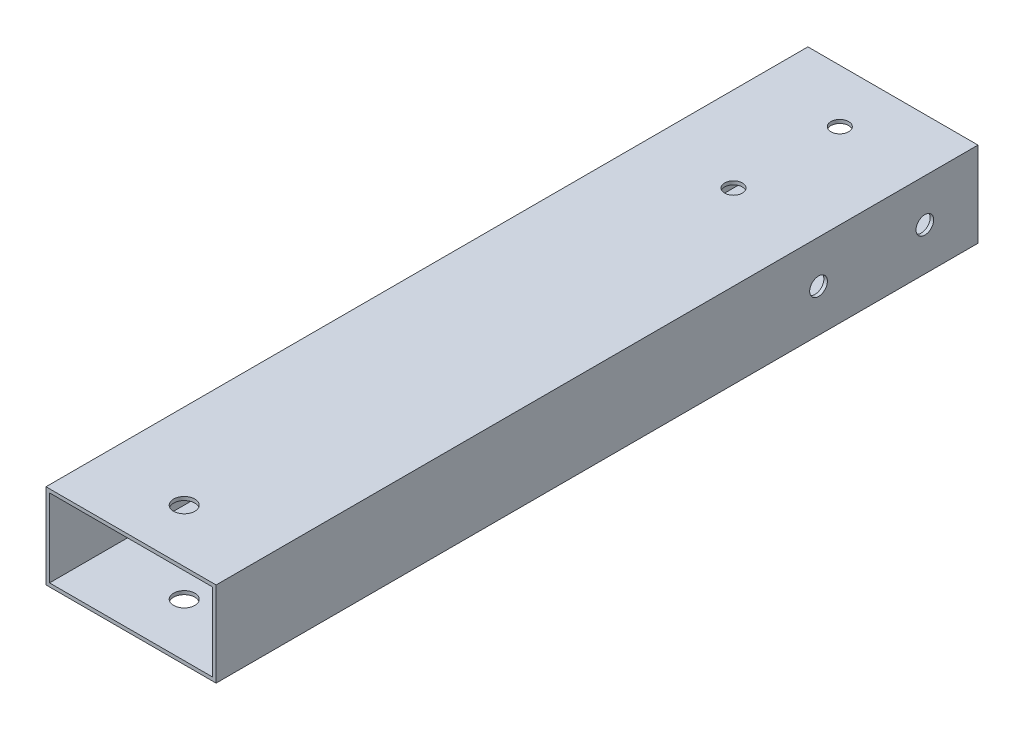
ISO-10303-21;
HEADER;
FILE_DESCRIPTION(('STEP AP214'),'2;1');
FILE_NAME('part.step','',(''),(''),'','','');
FILE_SCHEMA(('AUTOMOTIVE_DESIGN { 1 0 10303 214 1 1 1 1 }'));
ENDSEC;
DATA;
#1=APPLICATION_CONTEXT('core data for automotive mechanical design processes');
#2=APPLICATION_PROTOCOL_DEFINITION('international standard','automotive_design',2000,#1);
#3=PRODUCT_CONTEXT('',#1,'mechanical');
#4=PRODUCT('Part','Part','',(#3));
#5=PRODUCT_RELATED_PRODUCT_CATEGORY('part','',(#4));
#6=PRODUCT_DEFINITION_FORMATION('','',#4);
#7=PRODUCT_DEFINITION_CONTEXT('part definition',#1,'design');
#8=PRODUCT_DEFINITION('design','',#6,#7);
#9=PRODUCT_DEFINITION_SHAPE('','',#8);
#10=(LENGTH_UNIT() NAMED_UNIT(*) SI_UNIT(.MILLI.,.METRE.));
#11=(NAMED_UNIT(*) PLANE_ANGLE_UNIT() SI_UNIT($,.RADIAN.));
#12=(NAMED_UNIT(*) SI_UNIT($,.STERADIAN.) SOLID_ANGLE_UNIT());
#13=UNCERTAINTY_MEASURE_WITH_UNIT(LENGTH_MEASURE(1.E-05),#10,'distance_accuracy_value','');
#14=(GEOMETRIC_REPRESENTATION_CONTEXT(3) GLOBAL_UNCERTAINTY_ASSIGNED_CONTEXT((#13)) GLOBAL_UNIT_ASSIGNED_CONTEXT((#10,
#11,#12)) REPRESENTATION_CONTEXT('',''));
#15=CARTESIAN_POINT('',(0.,0.,0.));
#16=DIRECTION('',(0.,0.,1.));
#17=DIRECTION('',(1.,0.,0.));
#18=AXIS2_PLACEMENT_3D('',#15,#16,#17);
#19=CARTESIAN_POINT('',(0.,0.,0.));
#20=DIRECTION('',(0.,0.,1.));
#21=DIRECTION('',(1.,0.,0.));
#22=AXIS2_PLACEMENT_3D('',#19,#20,#21);
#23=PLANE('',#22);
#24=DIRECTION('',(0.,1.,0.));
#25=VECTOR('',#24,1.);
#26=CARTESIAN_POINT('',(24.,12.,0.));
#27=LINE('',#26,#25);
#28=CARTESIAN_POINT('',(24.,-12.,0.));
#29=VERTEX_POINT('',#28);
#30=CARTESIAN_POINT('',(24.,12.,0.));
#31=VERTEX_POINT('',#30);
#32=EDGE_CURVE('E209',#29,#31,#27,.T.);
#33=ORIENTED_EDGE('',*,*,#32,.F.);
#34=DIRECTION('',(1.,0.,0.));
#35=VECTOR('',#34,1.);
#36=CARTESIAN_POINT('',(-24.,-12.,0.));
#37=LINE('',#36,#35);
#38=CARTESIAN_POINT('',(-24.,-12.,0.));
#39=VERTEX_POINT('',#38);
#40=EDGE_CURVE('E215',#39,#29,#37,.T.);
#41=ORIENTED_EDGE('',*,*,#40,.F.);
#42=DIRECTION('',(0.,-1.,0.));
#43=VECTOR('',#42,1.);
#44=CARTESIAN_POINT('',(-24.,12.,0.));
#45=LINE('',#44,#43);
#46=CARTESIAN_POINT('',(-24.,12.,0.));
#47=VERTEX_POINT('',#46);
#48=EDGE_CURVE('E213',#47,#39,#45,.T.);
#49=ORIENTED_EDGE('',*,*,#48,.F.);
#50=DIRECTION('',(-1.,0.,0.));
#51=VECTOR('',#50,1.);
#52=CARTESIAN_POINT('',(-24.,12.,0.));
#53=LINE('',#52,#51);
#54=EDGE_CURVE('E122',#31,#47,#53,.T.);
#55=ORIENTED_EDGE('',*,*,#54,.F.);
#56=EDGE_LOOP('',(#33,#41,#49,#55));
#57=FACE_BOUND('',#56,.T.);
#58=DIRECTION('',(-1.,0.,0.));
#59=VECTOR('',#58,1.);
#60=CARTESIAN_POINT('',(-23.,11.,0.));
#61=LINE('',#60,#59);
#62=CARTESIAN_POINT('',(23.,11.,0.));
#63=VERTEX_POINT('',#62);
#64=CARTESIAN_POINT('',(-23.,11.,0.));
#65=VERTEX_POINT('',#64);
#66=EDGE_CURVE('E189',#63,#65,#61,.T.);
#67=ORIENTED_EDGE('',*,*,#66,.T.);
#68=DIRECTION('',(0.,-1.,0.));
#69=VECTOR('',#68,1.);
#70=CARTESIAN_POINT('',(-23.,11.,0.));
#71=LINE('',#70,#69);
#72=CARTESIAN_POINT('',(-23.,-11.,0.));
#73=VERTEX_POINT('',#72);
#74=EDGE_CURVE('E192',#65,#73,#71,.T.);
#75=ORIENTED_EDGE('',*,*,#74,.T.);
#76=DIRECTION('',(1.,0.,0.));
#77=VECTOR('',#76,1.);
#78=CARTESIAN_POINT('',(-23.,-11.,0.));
#79=LINE('',#78,#77);
#80=CARTESIAN_POINT('',(23.,-11.,0.));
#81=VERTEX_POINT('',#80);
#82=EDGE_CURVE('E195',#73,#81,#79,.T.);
#83=ORIENTED_EDGE('',*,*,#82,.T.);
#84=DIRECTION('',(0.,1.,0.));
#85=VECTOR('',#84,1.);
#86=CARTESIAN_POINT('',(23.,11.,0.));
#87=LINE('',#86,#85);
#88=EDGE_CURVE('E198',#81,#63,#87,.T.);
#89=ORIENTED_EDGE('',*,*,#88,.T.);
#90=EDGE_LOOP('',(#67,#75,#83,#89));
#91=FACE_BOUND('',#90,.T.);
#92=ADVANCED_FACE('F41',(#57,#91),#23,.F.);
#93=CARTESIAN_POINT('',(24.,12.,240.));
#94=DIRECTION('',(-1.,0.,0.));
#95=DIRECTION('',(0.,0.,1.));
#96=AXIS2_PLACEMENT_3D('',#93,#94,#95);
#97=PLANE('',#96);
#98=CARTESIAN_POINT('',(24.,0.,45.));
#99=DIRECTION('',(1.,0.,0.));
#100=DIRECTION('',(0.,0.,-1.));
#101=AXIS2_PLACEMENT_3D('',#98,#99,#100);
#102=CIRCLE('',#101,2.50000000000002);
#103=CARTESIAN_POINT('',(24.,0.,42.5));
#104=VERTEX_POINT('',#103);
#105=EDGE_CURVE('E148',#104,#104,#102,.T.);
#106=ORIENTED_EDGE('',*,*,#105,.F.);
#107=EDGE_LOOP('',(#106));
#108=FACE_BOUND('',#107,.T.);
#109=CARTESIAN_POINT('',(24.,0.,15.));
#110=DIRECTION('',(1.,0.,0.));
#111=DIRECTION('',(0.,0.,-1.));
#112=AXIS2_PLACEMENT_3D('',#109,#110,#111);
#113=CIRCLE('',#112,2.50000000000001);
#114=CARTESIAN_POINT('',(24.,0.,12.5));
#115=VERTEX_POINT('',#114);
#116=EDGE_CURVE('E256',#115,#115,#113,.T.);
#117=ORIENTED_EDGE('',*,*,#116,.F.);
#118=EDGE_LOOP('',(#117));
#119=FACE_BOUND('',#118,.T.);
#120=DIRECTION('',(0.,0.,-1.));
#121=VECTOR('',#120,1.);
#122=CARTESIAN_POINT('',(24.,12.,240.));
#123=LINE('',#122,#121);
#124=CARTESIAN_POINT('',(24.,12.,215.));
#125=VERTEX_POINT('',#124);
#126=EDGE_CURVE('E49',#125,#31,#123,.T.);
#127=ORIENTED_EDGE('',*,*,#126,.F.);
#128=DIRECTION('',(0.,-1.,0.));
#129=VECTOR('',#128,1.);
#130=CARTESIAN_POINT('',(24.,12.,215.));
#131=LINE('',#130,#129);
#132=CARTESIAN_POINT('',(24.,-12.,215.));
#133=VERTEX_POINT('',#132);
#134=EDGE_CURVE('E106',#125,#133,#131,.T.);
#135=ORIENTED_EDGE('',*,*,#134,.T.);
#136=DIRECTION('',(0.,0.,-1.));
#137=VECTOR('',#136,1.);
#138=CARTESIAN_POINT('',(24.,-12.,240.));
#139=LINE('',#138,#137);
#140=EDGE_CURVE('E126',#133,#29,#139,.T.);
#141=ORIENTED_EDGE('',*,*,#140,.T.);
#142=ORIENTED_EDGE('',*,*,#32,.T.);
#143=EDGE_LOOP('',(#127,#135,#141,#142));
#144=FACE_BOUND('',#143,.T.);
#145=ADVANCED_FACE('F43',(#108,#119,#144),#97,.F.);
#146=CARTESIAN_POINT('',(-24.,12.,240.));
#147=DIRECTION('',(0.,-1.,0.));
#148=DIRECTION('',(0.,0.,-1.));
#149=AXIS2_PLACEMENT_3D('',#146,#147,#148);
#150=PLANE('',#149);
#151=CARTESIAN_POINT('',(0.,12.,45.));
#152=DIRECTION('',(0.,-1.,0.));
#153=DIRECTION('',(0.,0.,-1.));
#154=AXIS2_PLACEMENT_3D('',#151,#152,#153);
#155=CIRCLE('',#154,2.5);
#156=CARTESIAN_POINT('',(0.,12.,42.5));
#157=VERTEX_POINT('',#156);
#158=EDGE_CURVE('E179',#157,#157,#155,.T.);
#159=ORIENTED_EDGE('',*,*,#158,.T.);
#160=EDGE_LOOP('',(#159));
#161=FACE_BOUND('',#160,.T.);
#162=CARTESIAN_POINT('',(0.,12.,15.));
#163=DIRECTION('',(0.,-1.,0.));
#164=DIRECTION('',(0.,0.,-1.));
#165=AXIS2_PLACEMENT_3D('',#162,#163,#164);
#166=CIRCLE('',#165,2.5);
#167=CARTESIAN_POINT('',(0.,12.,12.5));
#168=VERTEX_POINT('',#167);
#169=EDGE_CURVE('E144',#168,#168,#166,.T.);
#170=ORIENTED_EDGE('',*,*,#169,.T.);
#171=EDGE_LOOP('',(#170));
#172=FACE_BOUND('',#171,.T.);
#173=CARTESIAN_POINT('',(0.,12.,200.));
#174=DIRECTION('',(0.,-1.,0.));
#175=DIRECTION('',(0.,0.,-1.));
#176=AXIS2_PLACEMENT_3D('',#173,#174,#175);
#177=CIRCLE('',#176,3.);
#178=CARTESIAN_POINT('',(0.,12.,197.));
#179=VERTEX_POINT('',#178);
#180=EDGE_CURVE('E186',#179,#179,#177,.T.);
#181=ORIENTED_EDGE('',*,*,#180,.T.);
#182=EDGE_LOOP('',(#181));
#183=FACE_BOUND('',#182,.T.);
#184=DIRECTION('',(0.,0.,-1.));
#185=VECTOR('',#184,1.);
#186=CARTESIAN_POINT('',(-24.,12.,240.));
#187=LINE('',#186,#185);
#188=CARTESIAN_POINT('',(-24.,12.,215.));
#189=VERTEX_POINT('',#188);
#190=EDGE_CURVE('E116',#189,#47,#187,.T.);
#191=ORIENTED_EDGE('',*,*,#190,.F.);
#192=DIRECTION('',(1.,0.,0.));
#193=VECTOR('',#192,1.);
#194=CARTESIAN_POINT('',(-24.,12.,215.));
#195=LINE('',#194,#193);
#196=EDGE_CURVE('E103',#189,#125,#195,.T.);
#197=ORIENTED_EDGE('',*,*,#196,.T.);
#198=ORIENTED_EDGE('',*,*,#126,.T.);
#199=ORIENTED_EDGE('',*,*,#54,.T.);
#200=EDGE_LOOP('',(#191,#197,#198,#199));
#201=FACE_BOUND('',#200,.T.);
#202=ADVANCED_FACE('F120',(#161,#172,#183,#201),#150,.F.);
#203=CARTESIAN_POINT('',(-24.,12.,240.));
#204=DIRECTION('',(1.,0.,0.));
#205=DIRECTION('',(0.,0.,-1.));
#206=AXIS2_PLACEMENT_3D('',#203,#204,#205);
#207=PLANE('',#206);
#208=CARTESIAN_POINT('',(-24.,0.,45.));
#209=DIRECTION('',(1.,0.,0.));
#210=DIRECTION('',(0.,0.,-1.));
#211=AXIS2_PLACEMENT_3D('',#208,#209,#210);
#212=CIRCLE('',#211,2.50000000000002);
#213=CARTESIAN_POINT('',(-24.,0.,42.5));
#214=VERTEX_POINT('',#213);
#215=EDGE_CURVE('E156',#214,#214,#212,.T.);
#216=ORIENTED_EDGE('',*,*,#215,.T.);
#217=EDGE_LOOP('',(#216));
#218=FACE_BOUND('',#217,.T.);
#219=CARTESIAN_POINT('',(-24.,0.,15.));
#220=DIRECTION('',(1.,0.,0.));
#221=DIRECTION('',(0.,0.,-1.));
#222=AXIS2_PLACEMENT_3D('',#219,#220,#221);
#223=CIRCLE('',#222,2.50000000000001);
#224=CARTESIAN_POINT('',(-24.,0.,12.5));
#225=VERTEX_POINT('',#224);
#226=EDGE_CURVE('E152',#225,#225,#223,.T.);
#227=ORIENTED_EDGE('',*,*,#226,.T.);
#228=EDGE_LOOP('',(#227));
#229=FACE_BOUND('',#228,.T.);
#230=DIRECTION('',(0.,0.,-1.));
#231=VECTOR('',#230,1.);
#232=CARTESIAN_POINT('',(-24.,-12.,240.));
#233=LINE('',#232,#231);
#234=CARTESIAN_POINT('',(-24.,-12.,215.));
#235=VERTEX_POINT('',#234);
#236=EDGE_CURVE('E118',#235,#39,#233,.T.);
#237=ORIENTED_EDGE('',*,*,#236,.F.);
#238=DIRECTION('',(0.,-1.,0.));
#239=VECTOR('',#238,1.);
#240=CARTESIAN_POINT('',(-24.,12.,215.));
#241=LINE('',#240,#239);
#242=EDGE_CURVE('E56',#189,#235,#241,.T.);
#243=ORIENTED_EDGE('',*,*,#242,.F.);
#244=ORIENTED_EDGE('',*,*,#190,.T.);
#245=ORIENTED_EDGE('',*,*,#48,.T.);
#246=EDGE_LOOP('',(#237,#243,#244,#245));
#247=FACE_BOUND('',#246,.T.);
#248=ADVANCED_FACE('F114',(#218,#229,#247),#207,.F.);
#249=CARTESIAN_POINT('',(-24.,-12.,240.));
#250=DIRECTION('',(0.,1.,0.));
#251=DIRECTION('',(0.,0.,1.));
#252=AXIS2_PLACEMENT_3D('',#249,#250,#251);
#253=PLANE('',#252);
#254=CARTESIAN_POINT('',(0.,-12.,45.));
#255=DIRECTION('',(0.,-1.,0.));
#256=DIRECTION('',(0.,0.,-1.));
#257=AXIS2_PLACEMENT_3D('',#254,#255,#256);
#258=CIRCLE('',#257,2.5);
#259=CARTESIAN_POINT('',(0.,-12.,42.5));
#260=VERTEX_POINT('',#259);
#261=EDGE_CURVE('E139',#260,#260,#258,.T.);
#262=ORIENTED_EDGE('',*,*,#261,.F.);
#263=EDGE_LOOP('',(#262));
#264=FACE_BOUND('',#263,.T.);
#265=CARTESIAN_POINT('',(0.,-12.,15.));
#266=DIRECTION('',(0.,-1.,0.));
#267=DIRECTION('',(0.,0.,-1.));
#268=AXIS2_PLACEMENT_3D('',#265,#266,#267);
#269=CIRCLE('',#268,2.5);
#270=CARTESIAN_POINT('',(0.,-12.,12.5));
#271=VERTEX_POINT('',#270);
#272=EDGE_CURVE('E168',#271,#271,#269,.T.);
#273=ORIENTED_EDGE('',*,*,#272,.F.);
#274=EDGE_LOOP('',(#273));
#275=FACE_BOUND('',#274,.T.);
#276=CARTESIAN_POINT('',(0.,-12.,200.));
#277=DIRECTION('',(0.,-1.,0.));
#278=DIRECTION('',(0.,0.,-1.));
#279=AXIS2_PLACEMENT_3D('',#276,#277,#278);
#280=CIRCLE('',#279,3.);
#281=CARTESIAN_POINT('',(0.,-12.,197.));
#282=VERTEX_POINT('',#281);
#283=EDGE_CURVE('E134',#282,#282,#280,.T.);
#284=ORIENTED_EDGE('',*,*,#283,.F.);
#285=EDGE_LOOP('',(#284));
#286=FACE_BOUND('',#285,.T.);
#287=ORIENTED_EDGE('',*,*,#140,.F.);
#288=DIRECTION('',(1.,0.,0.));
#289=VECTOR('',#288,1.);
#290=CARTESIAN_POINT('',(-24.,-12.,215.));
#291=LINE('',#290,#289);
#292=EDGE_CURVE('E110',#235,#133,#291,.T.);
#293=ORIENTED_EDGE('',*,*,#292,.F.);
#294=ORIENTED_EDGE('',*,*,#236,.T.);
#295=ORIENTED_EDGE('',*,*,#40,.T.);
#296=EDGE_LOOP('',(#287,#293,#294,#295));
#297=FACE_BOUND('',#296,.T.);
#298=ADVANCED_FACE('F222',(#264,#275,#286,#297),#253,.F.);
#299=CARTESIAN_POINT('',(-23.,11.,240.));
#300=DIRECTION('',(0.,-1.,0.));
#301=DIRECTION('',(0.,0.,-1.));
#302=AXIS2_PLACEMENT_3D('',#299,#300,#301);
#303=PLANE('',#302);
#304=DIRECTION('',(1.,0.,0.));
#305=VECTOR('',#304,1.);
#306=CARTESIAN_POINT('',(-23.,11.,215.));
#307=LINE('',#306,#305);
#308=CARTESIAN_POINT('',(-23.,11.,215.));
#309=VERTEX_POINT('',#308);
#310=CARTESIAN_POINT('',(23.,11.,215.));
#311=VERTEX_POINT('',#310);
#312=EDGE_CURVE('E63',#309,#311,#307,.T.);
#313=ORIENTED_EDGE('',*,*,#312,.F.);
#314=DIRECTION('',(0.,0.,-1.));
#315=VECTOR('',#314,1.);
#316=CARTESIAN_POINT('',(-23.,11.,240.));
#317=LINE('',#316,#315);
#318=EDGE_CURVE('E207',#309,#65,#317,.T.);
#319=ORIENTED_EDGE('',*,*,#318,.T.);
#320=ORIENTED_EDGE('',*,*,#66,.F.);
#321=DIRECTION('',(0.,0.,-1.));
#322=VECTOR('',#321,1.);
#323=CARTESIAN_POINT('',(23.,11.,240.));
#324=LINE('',#323,#322);
#325=EDGE_CURVE('E201',#311,#63,#324,.T.);
#326=ORIENTED_EDGE('',*,*,#325,.F.);
#327=EDGE_LOOP('',(#313,#319,#320,#326));
#328=FACE_BOUND('',#327,.T.);
#329=CARTESIAN_POINT('',(0.,11.,45.));
#330=DIRECTION('',(0.,-1.,0.));
#331=DIRECTION('',(0.,0.,-1.));
#332=AXIS2_PLACEMENT_3D('',#329,#330,#331);
#333=CIRCLE('',#332,2.5);
#334=CARTESIAN_POINT('',(0.,11.,42.5));
#335=VERTEX_POINT('',#334);
#336=EDGE_CURVE('E143',#335,#335,#333,.T.);
#337=ORIENTED_EDGE('',*,*,#336,.F.);
#338=EDGE_LOOP('',(#337));
#339=FACE_BOUND('',#338,.T.);
#340=CARTESIAN_POINT('',(0.,11.,15.));
#341=DIRECTION('',(0.,-1.,0.));
#342=DIRECTION('',(0.,0.,-1.));
#343=AXIS2_PLACEMENT_3D('',#340,#341,#342);
#344=CIRCLE('',#343,2.5);
#345=CARTESIAN_POINT('',(0.,11.,12.5));
#346=VERTEX_POINT('',#345);
#347=EDGE_CURVE('E138',#346,#346,#344,.T.);
#348=ORIENTED_EDGE('',*,*,#347,.F.);
#349=EDGE_LOOP('',(#348));
#350=FACE_BOUND('',#349,.T.);
#351=CARTESIAN_POINT('',(0.,11.,200.));
#352=DIRECTION('',(0.,-1.,0.));
#353=DIRECTION('',(0.,0.,-1.));
#354=AXIS2_PLACEMENT_3D('',#351,#352,#353);
#355=CIRCLE('',#354,3.);
#356=CARTESIAN_POINT('',(0.,11.,197.));
#357=VERTEX_POINT('',#356);
#358=EDGE_CURVE('E133',#357,#357,#355,.T.);
#359=ORIENTED_EDGE('',*,*,#358,.F.);
#360=EDGE_LOOP('',(#359));
#361=FACE_BOUND('',#360,.T.);
#362=ADVANCED_FACE('F232',(#328,#339,#350,#361),#303,.T.);
#363=CARTESIAN_POINT('',(-23.,11.,240.));
#364=DIRECTION('',(1.,0.,0.));
#365=DIRECTION('',(0.,1.,0.));
#366=AXIS2_PLACEMENT_3D('',#363,#364,#365);
#367=PLANE('',#366);
#368=DIRECTION('',(0.,1.,0.));
#369=VECTOR('',#368,1.);
#370=CARTESIAN_POINT('',(-23.,11.,215.));
#371=LINE('',#370,#369);
#372=CARTESIAN_POINT('',(-23.,-11.,215.));
#373=VERTEX_POINT('',#372);
#374=EDGE_CURVE('E241',#373,#309,#371,.T.);
#375=ORIENTED_EDGE('',*,*,#374,.F.);
#376=DIRECTION('',(0.,0.,-1.));
#377=VECTOR('',#376,1.);
#378=CARTESIAN_POINT('',(-23.,-11.,240.));
#379=LINE('',#378,#377);
#380=EDGE_CURVE('E205',#373,#73,#379,.T.);
#381=ORIENTED_EDGE('',*,*,#380,.T.);
#382=ORIENTED_EDGE('',*,*,#74,.F.);
#383=ORIENTED_EDGE('',*,*,#318,.F.);
#384=EDGE_LOOP('',(#375,#381,#382,#383));
#385=FACE_BOUND('',#384,.T.);
#386=CARTESIAN_POINT('',(-23.,0.,45.));
#387=DIRECTION('',(1.,0.,0.));
#388=DIRECTION('',(0.,1.,0.));
#389=AXIS2_PLACEMENT_3D('',#386,#387,#388);
#390=CIRCLE('',#389,2.50000000000002);
#391=CARTESIAN_POINT('',(-23.,2.50000000000002,45.));
#392=VERTEX_POINT('',#391);
#393=EDGE_CURVE('E151',#392,#392,#390,.T.);
#394=ORIENTED_EDGE('',*,*,#393,.F.);
#395=EDGE_LOOP('',(#394));
#396=FACE_BOUND('',#395,.T.);
#397=CARTESIAN_POINT('',(-23.,0.,15.));
#398=DIRECTION('',(1.,0.,0.));
#399=DIRECTION('',(0.,1.,0.));
#400=AXIS2_PLACEMENT_3D('',#397,#398,#399);
#401=CIRCLE('',#400,2.50000000000001);
#402=CARTESIAN_POINT('',(-23.,2.50000000000001,15.));
#403=VERTEX_POINT('',#402);
#404=EDGE_CURVE('E147',#403,#403,#401,.T.);
#405=ORIENTED_EDGE('',*,*,#404,.F.);
#406=EDGE_LOOP('',(#405));
#407=FACE_BOUND('',#406,.T.);
#408=ADVANCED_FACE('F237',(#385,#396,#407),#367,.T.);
#409=CARTESIAN_POINT('',(-23.,-11.,240.));
#410=DIRECTION('',(0.,1.,0.));
#411=DIRECTION('',(0.,0.,1.));
#412=AXIS2_PLACEMENT_3D('',#409,#410,#411);
#413=PLANE('',#412);
#414=DIRECTION('',(-1.,0.,0.));
#415=VECTOR('',#414,1.);
#416=CARTESIAN_POINT('',(-23.,-11.,215.));
#417=LINE('',#416,#415);
#418=CARTESIAN_POINT('',(23.,-11.,215.));
#419=VERTEX_POINT('',#418);
#420=EDGE_CURVE('E247',#419,#373,#417,.T.);
#421=ORIENTED_EDGE('',*,*,#420,.F.);
#422=DIRECTION('',(0.,0.,-1.));
#423=VECTOR('',#422,1.);
#424=CARTESIAN_POINT('',(23.,-11.,240.));
#425=LINE('',#424,#423);
#426=EDGE_CURVE('E203',#419,#81,#425,.T.);
#427=ORIENTED_EDGE('',*,*,#426,.T.);
#428=ORIENTED_EDGE('',*,*,#82,.F.);
#429=ORIENTED_EDGE('',*,*,#380,.F.);
#430=EDGE_LOOP('',(#421,#427,#428,#429));
#431=FACE_BOUND('',#430,.T.);
#432=CARTESIAN_POINT('',(0.,-11.,45.));
#433=DIRECTION('',(0.,1.,0.));
#434=DIRECTION('',(0.,0.,1.));
#435=AXIS2_PLACEMENT_3D('',#432,#433,#434);
#436=CIRCLE('',#435,2.5);
#437=CARTESIAN_POINT('',(0.,-11.,47.5));
#438=VERTEX_POINT('',#437);
#439=EDGE_CURVE('E140',#438,#438,#436,.T.);
#440=ORIENTED_EDGE('',*,*,#439,.F.);
#441=EDGE_LOOP('',(#440));
#442=FACE_BOUND('',#441,.T.);
#443=CARTESIAN_POINT('',(0.,-11.,15.));
#444=DIRECTION('',(0.,1.,0.));
#445=DIRECTION('',(0.,0.,1.));
#446=AXIS2_PLACEMENT_3D('',#443,#444,#445);
#447=CIRCLE('',#446,2.5);
#448=CARTESIAN_POINT('',(0.,-11.,17.5));
#449=VERTEX_POINT('',#448);
#450=EDGE_CURVE('E135',#449,#449,#447,.T.);
#451=ORIENTED_EDGE('',*,*,#450,.F.);
#452=EDGE_LOOP('',(#451));
#453=FACE_BOUND('',#452,.T.);
#454=CARTESIAN_POINT('',(0.,-11.,200.));
#455=DIRECTION('',(0.,1.,0.));
#456=DIRECTION('',(0.,0.,1.));
#457=AXIS2_PLACEMENT_3D('',#454,#455,#456);
#458=CIRCLE('',#457,3.);
#459=CARTESIAN_POINT('',(0.,-11.,203.));
#460=VERTEX_POINT('',#459);
#461=EDGE_CURVE('E130',#460,#460,#458,.T.);
#462=ORIENTED_EDGE('',*,*,#461,.F.);
#463=EDGE_LOOP('',(#462));
#464=FACE_BOUND('',#463,.T.);
#465=ADVANCED_FACE('F244',(#431,#442,#453,#464),#413,.T.);
#466=CARTESIAN_POINT('',(23.,11.,240.));
#467=DIRECTION('',(-1.,0.,0.));
#468=DIRECTION('',(0.,0.,1.));
#469=AXIS2_PLACEMENT_3D('',#466,#467,#468);
#470=PLANE('',#469);
#471=DIRECTION('',(0.,-1.,0.));
#472=VECTOR('',#471,1.);
#473=CARTESIAN_POINT('',(23.,11.,215.));
#474=LINE('',#473,#472);
#475=EDGE_CURVE('E11',#311,#419,#474,.T.);
#476=ORIENTED_EDGE('',*,*,#475,.F.);
#477=ORIENTED_EDGE('',*,*,#325,.T.);
#478=ORIENTED_EDGE('',*,*,#88,.F.);
#479=ORIENTED_EDGE('',*,*,#426,.F.);
#480=EDGE_LOOP('',(#476,#477,#478,#479));
#481=FACE_BOUND('',#480,.T.);
#482=CARTESIAN_POINT('',(23.,0.,45.));
#483=DIRECTION('',(-1.,0.,0.));
#484=DIRECTION('',(0.,0.,1.));
#485=AXIS2_PLACEMENT_3D('',#482,#483,#484);
#486=CIRCLE('',#485,2.50000000000002);
#487=CARTESIAN_POINT('',(23.,0.,47.5));
#488=VERTEX_POINT('',#487);
#489=EDGE_CURVE('E149',#488,#488,#486,.T.);
#490=ORIENTED_EDGE('',*,*,#489,.F.);
#491=EDGE_LOOP('',(#490));
#492=FACE_BOUND('',#491,.T.);
#493=CARTESIAN_POINT('',(23.,0.,15.));
#494=DIRECTION('',(-1.,0.,0.));
#495=DIRECTION('',(0.,0.,1.));
#496=AXIS2_PLACEMENT_3D('',#493,#494,#495);
#497=CIRCLE('',#496,2.50000000000001);
#498=CARTESIAN_POINT('',(23.,0.,17.5));
#499=VERTEX_POINT('',#498);
#500=EDGE_CURVE('E145',#499,#499,#497,.T.);
#501=ORIENTED_EDGE('',*,*,#500,.F.);
#502=EDGE_LOOP('',(#501));
#503=FACE_BOUND('',#502,.T.);
#504=ADVANCED_FACE('F249',(#481,#492,#503),#470,.T.);
#505=CARTESIAN_POINT('',(0.,228.,200.));
#506=DIRECTION('',(0.,-1.,0.));
#507=DIRECTION('',(0.,0.,-1.));
#508=AXIS2_PLACEMENT_3D('',#505,#506,#507);
#509=CYLINDRICAL_SURFACE('',#508,3.);
#510=ORIENTED_EDGE('',*,*,#461,.T.);
#511=EDGE_LOOP('',(#510));
#512=FACE_BOUND('',#511,.T.);
#513=ORIENTED_EDGE('',*,*,#283,.T.);
#514=EDGE_LOOP('',(#513));
#515=FACE_BOUND('',#514,.T.);
#516=ADVANCED_FACE('F310',(#512,#515),#509,.F.);
#517=ORIENTED_EDGE('',*,*,#358,.T.);
#518=EDGE_LOOP('',(#517));
#519=FACE_BOUND('',#518,.T.);
#520=ORIENTED_EDGE('',*,*,#180,.F.);
#521=EDGE_LOOP('',(#520));
#522=FACE_BOUND('',#521,.T.);
#523=ADVANCED_FACE('F313',(#519,#522),#509,.F.);
#524=CARTESIAN_POINT('',(0.,228.,15.));
#525=DIRECTION('',(0.,-1.,0.));
#526=DIRECTION('',(0.,0.,-1.));
#527=AXIS2_PLACEMENT_3D('',#524,#525,#526);
#528=CYLINDRICAL_SURFACE('',#527,2.5);
#529=ORIENTED_EDGE('',*,*,#450,.T.);
#530=EDGE_LOOP('',(#529));
#531=FACE_BOUND('',#530,.T.);
#532=ORIENTED_EDGE('',*,*,#272,.T.);
#533=EDGE_LOOP('',(#532));
#534=FACE_BOUND('',#533,.T.);
#535=ADVANCED_FACE('F315',(#531,#534),#528,.F.);
#536=CARTESIAN_POINT('',(0.,228.,45.));
#537=DIRECTION('',(0.,-1.,0.));
#538=DIRECTION('',(0.,0.,-1.));
#539=AXIS2_PLACEMENT_3D('',#536,#537,#538);
#540=CYLINDRICAL_SURFACE('',#539,2.5);
#541=ORIENTED_EDGE('',*,*,#439,.T.);
#542=EDGE_LOOP('',(#541));
#543=FACE_BOUND('',#542,.T.);
#544=ORIENTED_EDGE('',*,*,#261,.T.);
#545=EDGE_LOOP('',(#544));
#546=FACE_BOUND('',#545,.T.);
#547=ADVANCED_FACE('F318',(#543,#546),#540,.F.);
#548=ORIENTED_EDGE('',*,*,#347,.T.);
#549=EDGE_LOOP('',(#548));
#550=FACE_BOUND('',#549,.T.);
#551=ORIENTED_EDGE('',*,*,#169,.F.);
#552=EDGE_LOOP('',(#551));
#553=FACE_BOUND('',#552,.T.);
#554=ADVANCED_FACE('F320',(#550,#553),#528,.F.);
#555=ORIENTED_EDGE('',*,*,#336,.T.);
#556=EDGE_LOOP('',(#555));
#557=FACE_BOUND('',#556,.T.);
#558=ORIENTED_EDGE('',*,*,#158,.F.);
#559=EDGE_LOOP('',(#558));
#560=FACE_BOUND('',#559,.T.);
#561=ADVANCED_FACE('F283',(#557,#560),#540,.F.);
#562=CARTESIAN_POINT('',(-216.,0.,15.));
#563=DIRECTION('',(1.,0.,0.));
#564=DIRECTION('',(0.,0.,-1.));
#565=AXIS2_PLACEMENT_3D('',#562,#563,#564);
#566=CYLINDRICAL_SURFACE('',#565,2.50000000000001);
#567=ORIENTED_EDGE('',*,*,#500,.T.);
#568=EDGE_LOOP('',(#567));
#569=FACE_BOUND('',#568,.T.);
#570=ORIENTED_EDGE('',*,*,#116,.T.);
#571=EDGE_LOOP('',(#570));
#572=FACE_BOUND('',#571,.T.);
#573=ADVANCED_FACE('F261',(#569,#572),#566,.F.);
#574=CARTESIAN_POINT('',(-216.,0.,45.));
#575=DIRECTION('',(1.,0.,0.));
#576=DIRECTION('',(0.,0.,-1.));
#577=AXIS2_PLACEMENT_3D('',#574,#575,#576);
#578=CYLINDRICAL_SURFACE('',#577,2.50000000000002);
#579=ORIENTED_EDGE('',*,*,#489,.T.);
#580=EDGE_LOOP('',(#579));
#581=FACE_BOUND('',#580,.T.);
#582=ORIENTED_EDGE('',*,*,#105,.T.);
#583=EDGE_LOOP('',(#582));
#584=FACE_BOUND('',#583,.T.);
#585=ADVANCED_FACE('F272',(#581,#584),#578,.F.);
#586=ORIENTED_EDGE('',*,*,#404,.T.);
#587=EDGE_LOOP('',(#586));
#588=FACE_BOUND('',#587,.T.);
#589=ORIENTED_EDGE('',*,*,#226,.F.);
#590=EDGE_LOOP('',(#589));
#591=FACE_BOUND('',#590,.T.);
#592=ADVANCED_FACE('F274',(#588,#591),#566,.F.);
#593=ORIENTED_EDGE('',*,*,#393,.T.);
#594=EDGE_LOOP('',(#593));
#595=FACE_BOUND('',#594,.T.);
#596=ORIENTED_EDGE('',*,*,#215,.F.);
#597=EDGE_LOOP('',(#596));
#598=FACE_BOUND('',#597,.T.);
#599=ADVANCED_FACE('F276',(#595,#598),#578,.F.);
#600=CARTESIAN_POINT('',(-24.,12.,215.));
#601=DIRECTION('',(0.,0.,-1.));
#602=DIRECTION('',(-1.,0.,0.));
#603=AXIS2_PLACEMENT_3D('',#600,#601,#602);
#604=PLANE('',#603);
#605=ORIENTED_EDGE('',*,*,#312,.T.);
#606=ORIENTED_EDGE('',*,*,#475,.T.);
#607=ORIENTED_EDGE('',*,*,#420,.T.);
#608=ORIENTED_EDGE('',*,*,#374,.T.);
#609=EDGE_LOOP('',(#605,#606,#607,#608));
#610=FACE_BOUND('',#609,.T.);
#611=ORIENTED_EDGE('',*,*,#292,.T.);
#612=ORIENTED_EDGE('',*,*,#134,.F.);
#613=ORIENTED_EDGE('',*,*,#196,.F.);
#614=ORIENTED_EDGE('',*,*,#242,.T.);
#615=EDGE_LOOP('',(#611,#612,#613,#614));
#616=FACE_BOUND('',#615,.T.);
#617=ADVANCED_FACE('F104',(#610,#616),#604,.F.);
#618=CLOSED_SHELL('',(#92,#145,#202,#248,#298,#362,#408,#465,#504,#516,#523,#535,#547,#554,#561,
#573,#585,#592,#599,#617));
#619=MANIFOLD_SOLID_BREP('B2',#618);
#620=ADVANCED_BREP_SHAPE_REPRESENTATION('',(#18,#619),#14);
#621=SHAPE_DEFINITION_REPRESENTATION(#9,#620);
ENDSEC;
END-ISO-10303-21;
